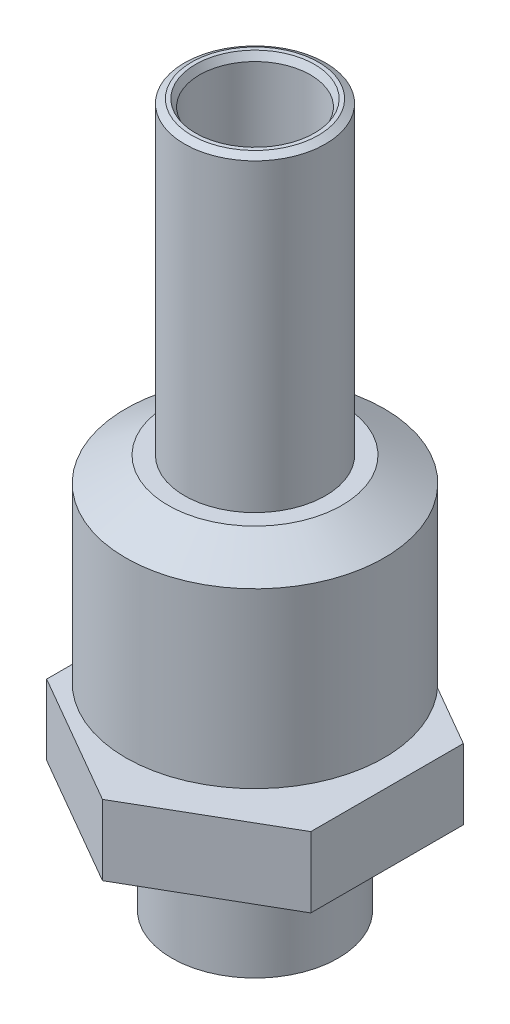
ISO-10303-21;
HEADER;
FILE_DESCRIPTION(('STEP AP214'),'2;1');
FILE_NAME('part.step','',(''),(''),'','','');
FILE_SCHEMA(('AUTOMOTIVE_DESIGN { 1 0 10303 214 1 1 1 1 }'));
ENDSEC;
DATA;
#1=APPLICATION_CONTEXT('core data for automotive mechanical design processes');
#2=APPLICATION_PROTOCOL_DEFINITION('international standard','automotive_design',2000,#1);
#3=PRODUCT_CONTEXT('',#1,'mechanical');
#4=PRODUCT('Part','Part','',(#3));
#5=PRODUCT_RELATED_PRODUCT_CATEGORY('part','',(#4));
#6=PRODUCT_DEFINITION_FORMATION('','',#4);
#7=PRODUCT_DEFINITION_CONTEXT('part definition',#1,'design');
#8=PRODUCT_DEFINITION('design','',#6,#7);
#9=PRODUCT_DEFINITION_SHAPE('','',#8);
#10=(LENGTH_UNIT() NAMED_UNIT(*) SI_UNIT(.MILLI.,.METRE.));
#11=(NAMED_UNIT(*) PLANE_ANGLE_UNIT() SI_UNIT($,.RADIAN.));
#12=(NAMED_UNIT(*) SI_UNIT($,.STERADIAN.) SOLID_ANGLE_UNIT());
#13=UNCERTAINTY_MEASURE_WITH_UNIT(LENGTH_MEASURE(1.E-05),#10,'distance_accuracy_value','');
#14=(GEOMETRIC_REPRESENTATION_CONTEXT(3) GLOBAL_UNCERTAINTY_ASSIGNED_CONTEXT((#13)) GLOBAL_UNIT_ASSIGNED_CONTEXT((#10,
#11,#12)) REPRESENTATION_CONTEXT('',''));
#15=CARTESIAN_POINT('',(0.,0.,0.));
#16=DIRECTION('',(0.,0.,1.));
#17=DIRECTION('',(1.,0.,0.));
#18=AXIS2_PLACEMENT_3D('',#15,#16,#17);
#19=CARTESIAN_POINT('',(4.7625,27.432,2.74963065701559));
#20=DIRECTION('',(-1.,0.,0.));
#21=DIRECTION('',(0.,0.,1.));
#22=AXIS2_PLACEMENT_3D('',#19,#20,#21);
#23=PLANE('',#22);
#24=DIRECTION('',(0.,0.,1.));
#25=VECTOR('',#24,1.);
#26=CARTESIAN_POINT('',(4.7625,5.762,2.74963065701559));
#27=LINE('',#26,#25);
#28=CARTESIAN_POINT('',(4.7625,5.762,-2.74963065701559));
#29=VERTEX_POINT('',#28);
#30=CARTESIAN_POINT('',(4.7625,5.762,2.74963065701559));
#31=VERTEX_POINT('',#30);
#32=EDGE_CURVE('E53',#29,#31,#27,.T.);
#33=ORIENTED_EDGE('',*,*,#32,.F.);
#34=DIRECTION('',(0.,-1.,0.));
#35=VECTOR('',#34,1.);
#36=CARTESIAN_POINT('',(4.7625,27.432,-2.74963065701559));
#37=LINE('',#36,#35);
#38=CARTESIAN_POINT('',(4.7625,8.302,-2.74963065701559));
#39=VERTEX_POINT('',#38);
#40=EDGE_CURVE('E121',#39,#29,#37,.T.);
#41=ORIENTED_EDGE('',*,*,#40,.F.);
#42=DIRECTION('',(0.,0.,1.));
#43=VECTOR('',#42,1.);
#44=CARTESIAN_POINT('',(4.7625,8.302,2.74963065701559));
#45=LINE('',#44,#43);
#46=CARTESIAN_POINT('',(4.7625,8.302,2.74963065701559));
#47=VERTEX_POINT('',#46);
#48=EDGE_CURVE('E112',#39,#47,#45,.T.);
#49=ORIENTED_EDGE('',*,*,#48,.T.);
#50=DIRECTION('',(0.,-1.,0.));
#51=VECTOR('',#50,1.);
#52=CARTESIAN_POINT('',(4.7625,27.432,2.74963065701559));
#53=LINE('',#52,#51);
#54=EDGE_CURVE('E108',#47,#31,#53,.T.);
#55=ORIENTED_EDGE('',*,*,#54,.T.);
#56=EDGE_LOOP('',(#33,#41,#49,#55));
#57=FACE_BOUND('',#56,.T.);
#58=ADVANCED_FACE('F39',(#57),#23,.F.);
#59=CARTESIAN_POINT('',(4.7625,27.432,-2.74963065701559));
#60=DIRECTION('',(-0.5,0.,0.866025403784439));
#61=DIRECTION('',(0.866025403784439,0.,0.5));
#62=AXIS2_PLACEMENT_3D('',#59,#60,#61);
#63=PLANE('',#62);
#64=DIRECTION('',(0.866025403784439,0.,0.5));
#65=VECTOR('',#64,1.);
#66=CARTESIAN_POINT('',(4.76249999999999,5.762,-2.7496306570156));
#67=LINE('',#66,#65);
#68=CARTESIAN_POINT('',(0.,5.762,-5.49926131403118));
#69=VERTEX_POINT('',#68);
#70=EDGE_CURVE('E157',#69,#29,#67,.T.);
#71=ORIENTED_EDGE('',*,*,#70,.F.);
#72=DIRECTION('',(0.,-1.,0.));
#73=VECTOR('',#72,1.);
#74=CARTESIAN_POINT('',(0.,27.432,-5.49926131403118));
#75=LINE('',#74,#73);
#76=CARTESIAN_POINT('',(0.,8.302,-5.49926131403118));
#77=VERTEX_POINT('',#76);
#78=EDGE_CURVE('E118',#77,#69,#75,.T.);
#79=ORIENTED_EDGE('',*,*,#78,.F.);
#80=DIRECTION('',(0.866025403784439,0.,0.5));
#81=VECTOR('',#80,1.);
#82=CARTESIAN_POINT('',(4.7625,8.302,-2.74963065701559));
#83=LINE('',#82,#81);
#84=EDGE_CURVE('E192',#77,#39,#83,.T.);
#85=ORIENTED_EDGE('',*,*,#84,.T.);
#86=ORIENTED_EDGE('',*,*,#40,.T.);
#87=EDGE_LOOP('',(#71,#79,#85,#86));
#88=FACE_BOUND('',#87,.T.);
#89=ADVANCED_FACE('F201',(#88),#63,.F.);
#90=CARTESIAN_POINT('',(0.,27.432,-5.49926131403118));
#91=DIRECTION('',(0.500000000000001,0.,0.866025403784438));
#92=DIRECTION('',(0.866025403784438,0.,-0.500000000000001));
#93=AXIS2_PLACEMENT_3D('',#90,#91,#92);
#94=PLANE('',#93);
#95=DIRECTION('',(0.866025403784438,0.,-0.500000000000001));
#96=VECTOR('',#95,1.);
#97=CARTESIAN_POINT('',(0.,5.762,-5.49926131403118));
#98=LINE('',#97,#96);
#99=CARTESIAN_POINT('',(-4.7625,5.762,-2.74963065701559));
#100=VERTEX_POINT('',#99);
#101=EDGE_CURVE('E155',#100,#69,#98,.T.);
#102=ORIENTED_EDGE('',*,*,#101,.F.);
#103=DIRECTION('',(0.,-1.,0.));
#104=VECTOR('',#103,1.);
#105=CARTESIAN_POINT('',(-4.7625,27.432,-2.74963065701559));
#106=LINE('',#105,#104);
#107=CARTESIAN_POINT('',(-4.7625,8.302,-2.74963065701559));
#108=VERTEX_POINT('',#107);
#109=EDGE_CURVE('E110',#108,#100,#106,.T.);
#110=ORIENTED_EDGE('',*,*,#109,.F.);
#111=DIRECTION('',(0.866025403784438,0.,-0.500000000000001));
#112=VECTOR('',#111,1.);
#113=CARTESIAN_POINT('',(0.,8.302,-5.49926131403118));
#114=LINE('',#113,#112);
#115=EDGE_CURVE('E189',#108,#77,#114,.T.);
#116=ORIENTED_EDGE('',*,*,#115,.T.);
#117=ORIENTED_EDGE('',*,*,#78,.T.);
#118=EDGE_LOOP('',(#102,#110,#116,#117));
#119=FACE_BOUND('',#118,.T.);
#120=ADVANCED_FACE('F204',(#119),#94,.F.);
#121=CARTESIAN_POINT('',(-4.7625,27.432,-2.74963065701559));
#122=DIRECTION('',(1.,0.,0.));
#123=DIRECTION('',(0.,0.,-1.));
#124=AXIS2_PLACEMENT_3D('',#121,#122,#123);
#125=PLANE('',#124);
#126=DIRECTION('',(0.,0.,-1.));
#127=VECTOR('',#126,1.);
#128=CARTESIAN_POINT('',(-4.7625,5.762,-2.74963065701559));
#129=LINE('',#128,#127);
#130=CARTESIAN_POINT('',(-4.7625,5.762,2.7496306570156));
#131=VERTEX_POINT('',#130);
#132=EDGE_CURVE('E103',#131,#100,#129,.T.);
#133=ORIENTED_EDGE('',*,*,#132,.F.);
#134=DIRECTION('',(0.,-1.,0.));
#135=VECTOR('',#134,1.);
#136=CARTESIAN_POINT('',(-4.7625,27.432,2.7496306570156));
#137=LINE('',#136,#135);
#138=CARTESIAN_POINT('',(-4.7625,8.302,2.7496306570156));
#139=VERTEX_POINT('',#138);
#140=EDGE_CURVE('E102',#139,#131,#137,.T.);
#141=ORIENTED_EDGE('',*,*,#140,.F.);
#142=DIRECTION('',(0.,0.,-1.));
#143=VECTOR('',#142,1.);
#144=CARTESIAN_POINT('',(-4.7625,8.302,-2.74963065701559));
#145=LINE('',#144,#143);
#146=EDGE_CURVE('E186',#139,#108,#145,.T.);
#147=ORIENTED_EDGE('',*,*,#146,.T.);
#148=ORIENTED_EDGE('',*,*,#109,.T.);
#149=EDGE_LOOP('',(#133,#141,#147,#148));
#150=FACE_BOUND('',#149,.T.);
#151=ADVANCED_FACE('F207',(#150),#125,.F.);
#152=CARTESIAN_POINT('',(-4.7625,27.432,2.7496306570156));
#153=DIRECTION('',(0.5,0.,-0.866025403784439));
#154=DIRECTION('',(-0.866025403784439,0.,-0.5));
#155=AXIS2_PLACEMENT_3D('',#152,#153,#154);
#156=PLANE('',#155);
#157=DIRECTION('',(-0.866025403784439,0.,-0.5));
#158=VECTOR('',#157,1.);
#159=CARTESIAN_POINT('',(-4.7625,5.762,2.74963065701559));
#160=LINE('',#159,#158);
#161=CARTESIAN_POINT('',(0.,5.762,5.49926131403119));
#162=VERTEX_POINT('',#161);
#163=EDGE_CURVE('E90',#162,#131,#160,.T.);
#164=ORIENTED_EDGE('',*,*,#163,.F.);
#165=DIRECTION('',(0.,-1.,0.));
#166=VECTOR('',#165,1.);
#167=CARTESIAN_POINT('',(0.,27.432,5.49926131403119));
#168=LINE('',#167,#166);
#169=CARTESIAN_POINT('',(0.,8.302,5.49926131403119));
#170=VERTEX_POINT('',#169);
#171=EDGE_CURVE('E100',#170,#162,#168,.T.);
#172=ORIENTED_EDGE('',*,*,#171,.F.);
#173=DIRECTION('',(-0.866025403784439,0.,-0.5));
#174=VECTOR('',#173,1.);
#175=CARTESIAN_POINT('',(-4.7625,8.302,2.7496306570156));
#176=LINE('',#175,#174);
#177=EDGE_CURVE('E61',#170,#139,#176,.T.);
#178=ORIENTED_EDGE('',*,*,#177,.T.);
#179=ORIENTED_EDGE('',*,*,#140,.T.);
#180=EDGE_LOOP('',(#164,#172,#178,#179));
#181=FACE_BOUND('',#180,.T.);
#182=ADVANCED_FACE('F99',(#181),#156,.F.);
#183=CARTESIAN_POINT('',(0.,27.432,5.49926131403119));
#184=DIRECTION('',(-0.5,0.,-0.866025403784438));
#185=DIRECTION('',(-0.866025403784438,0.,0.5));
#186=AXIS2_PLACEMENT_3D('',#183,#184,#185);
#187=PLANE('',#186);
#188=DIRECTION('',(-0.866025403784438,0.,0.5));
#189=VECTOR('',#188,1.);
#190=CARTESIAN_POINT('',(0.,5.762,5.49926131403119));
#191=LINE('',#190,#189);
#192=EDGE_CURVE('E11',#31,#162,#191,.T.);
#193=ORIENTED_EDGE('',*,*,#192,.F.);
#194=ORIENTED_EDGE('',*,*,#54,.F.);
#195=DIRECTION('',(-0.866025403784438,0.,0.5));
#196=VECTOR('',#195,1.);
#197=CARTESIAN_POINT('',(0.,8.302,5.49926131403119));
#198=LINE('',#197,#196);
#199=EDGE_CURVE('E107',#47,#170,#198,.T.);
#200=ORIENTED_EDGE('',*,*,#199,.T.);
#201=ORIENTED_EDGE('',*,*,#171,.T.);
#202=EDGE_LOOP('',(#193,#194,#200,#201));
#203=FACE_BOUND('',#202,.T.);
#204=ADVANCED_FACE('F106',(#203),#187,.F.);
#205=CARTESIAN_POINT('',(0.,1.39107264208463,0.));
#206=DIRECTION('',(0.,1.,0.));
#207=DIRECTION('',(0.,0.,1.));
#208=AXIS2_PLACEMENT_3D('',#205,#206,#207);
#209=CONICAL_SURFACE('',#208,0.,1.08210413623648);
#210=CARTESIAN_POINT('',(0.,1.92116035997955,0.));
#211=DIRECTION('',(0.,-1.,0.));
#212=DIRECTION('',(0.,0.,-1.));
#213=AXIS2_PLACEMENT_3D('',#210,#211,#212);
#214=CIRCLE('',#213,0.996949999999998);
#215=CARTESIAN_POINT('',(0.,1.92116035997955,0.996949999999998));
#216=VERTEX_POINT('',#215);
#217=EDGE_CURVE('E160',#216,#216,#214,.T.);
#218=CARTESIAN_POINT('',(0.,1.524,0.));
#219=DIRECTION('',(0.,-1.,0.));
#220=DIRECTION('',(1.,0.,0.));
#221=AXIS2_PLACEMENT_3D('',#218,#219,#220);
#222=CIRCLE('',#221,0.249999999999995);
#223=CARTESIAN_POINT('',(0.,1.524,0.249999999999995));
#224=VERTEX_POINT('',#223);
#225=EDGE_CURVE('E104',#224,#224,#222,.F.);
#226=CARTESIAN_POINT('',(0.,1.92116035997955,0.996949999999998));
#227=CARTESIAN_POINT('',(0.,1.91702327289643,0.989169270833332));
#228=CARTESIAN_POINT('',(0.,1.91288618581331,0.981388541666665));
#229=CARTESIAN_POINT('',(0.,1.90461201164707,0.965827083333331));
#230=CARTESIAN_POINT('',(0.,1.90047492456395,0.958046354166665));
#231=CARTESIAN_POINT('',(0.,1.89220075039771,0.942484895833331));
#232=CARTESIAN_POINT('',(0.,1.88806366331458,0.934704166666665));
#233=CARTESIAN_POINT('',(0.,1.87978948914834,0.919142708333331));
#234=CARTESIAN_POINT('',(0.,1.87565240206522,0.911361979166665));
#235=CARTESIAN_POINT('',(0.,1.86737822789898,0.895800520833331));
#236=CARTESIAN_POINT('',(0.,1.86324114081586,0.888019791666664));
#237=CARTESIAN_POINT('',(0.,1.85496696664962,0.872458333333331));
#238=CARTESIAN_POINT('',(0.,1.8508298795665,0.864677604166664));
#239=CARTESIAN_POINT('',(0.,1.84255570540026,0.849116145833331));
#240=CARTESIAN_POINT('',(0.,1.83841861831714,0.841335416666664));
#241=CARTESIAN_POINT('',(0.,1.8301444441509,0.825773958333331));
#242=CARTESIAN_POINT('',(0.,1.82600735706778,0.817993229166664));
#243=CARTESIAN_POINT('',(0.,1.81773318290154,0.802431770833331));
#244=CARTESIAN_POINT('',(0.,1.81359609581842,0.794651041666664));
#245=CARTESIAN_POINT('',(0.,1.80532192165218,0.779089583333331));
#246=CARTESIAN_POINT('',(0.,1.80118483456906,0.771308854166664));
#247=CARTESIAN_POINT('',(0.,1.79291066040282,0.755747395833331));
#248=CARTESIAN_POINT('',(0.,1.7887735733197,0.747966666666664));
#249=CARTESIAN_POINT('',(0.,1.78049939915346,0.73240520833333));
#250=CARTESIAN_POINT('',(0.,1.77636231207034,0.724624479166664));
#251=CARTESIAN_POINT('',(0.,1.7680881379041,0.70906302083333));
#252=CARTESIAN_POINT('',(0.,1.76395105082098,0.701282291666664));
#253=CARTESIAN_POINT('',(0.,1.75567687665474,0.68572083333333));
#254=CARTESIAN_POINT('',(0.,1.75153978957162,0.677940104166664));
#255=CARTESIAN_POINT('',(0.,1.74326561540537,0.66237864583333));
#256=CARTESIAN_POINT('',(0.,1.73912852832225,0.654597916666663));
#257=CARTESIAN_POINT('',(0.,1.73085435415601,0.63903645833333));
#258=CARTESIAN_POINT('',(0.,1.72671726707289,0.631255729166663));
#259=CARTESIAN_POINT('',(0.,1.71844309290665,0.61569427083333));
#260=CARTESIAN_POINT('',(0.,1.71430600582353,0.607913541666663));
#261=CARTESIAN_POINT('',(0.,1.70603183165729,0.59235208333333));
#262=CARTESIAN_POINT('',(0.,1.70189474457417,0.584571354166663));
#263=CARTESIAN_POINT('',(0.,1.69362057040793,0.56900989583333));
#264=CARTESIAN_POINT('',(0.,1.68948348332481,0.561229166666663));
#265=CARTESIAN_POINT('',(0.,1.68120930915857,0.545667708333329));
#266=CARTESIAN_POINT('',(0.,1.67707222207545,0.537886979166663));
#267=CARTESIAN_POINT('',(0.,1.66879804790921,0.522325520833329));
#268=CARTESIAN_POINT('',(0.,1.66466096082609,0.514544791666663));
#269=CARTESIAN_POINT('',(0.,1.65638678665985,0.498983333333329));
#270=CARTESIAN_POINT('',(0.,1.65224969957673,0.491202604166663));
#271=CARTESIAN_POINT('',(0.,1.64397552541049,0.475641145833329));
#272=CARTESIAN_POINT('',(0.,1.63983843832737,0.467860416666663));
#273=CARTESIAN_POINT('',(0.,1.63156426416113,0.452298958333329));
#274=CARTESIAN_POINT('',(0.,1.62742717707801,0.444518229166662));
#275=CARTESIAN_POINT('',(0.,1.61915300291177,0.428956770833329));
#276=CARTESIAN_POINT('',(0.,1.61501591582865,0.421176041666662));
#277=CARTESIAN_POINT('',(0.,1.60674174166241,0.405614583333329));
#278=CARTESIAN_POINT('',(0.,1.60260465457929,0.397833854166662));
#279=CARTESIAN_POINT('',(0.,1.59433048041304,0.382272395833329));
#280=CARTESIAN_POINT('',(0.,1.59019339332992,0.374491666666662));
#281=CARTESIAN_POINT('',(0.,1.58191921916368,0.358930208333329));
#282=CARTESIAN_POINT('',(0.,1.57778213208056,0.351149479166662));
#283=CARTESIAN_POINT('',(0.,1.56950795791432,0.335588020833329));
#284=CARTESIAN_POINT('',(0.,1.5653708708312,0.327807291666662));
#285=CARTESIAN_POINT('',(0.,1.55709669666496,0.312245833333328));
#286=CARTESIAN_POINT('',(0.,1.55295960958184,0.304465104166662));
#287=CARTESIAN_POINT('',(0.,1.5446854354156,0.288903645833328));
#288=CARTESIAN_POINT('',(0.,1.54054834833248,0.281122916666662));
#289=CARTESIAN_POINT('',(0.,1.53227417416624,0.265561458333328));
#290=CARTESIAN_POINT('',(0.,1.52813708708312,0.257780729166661));
#291=CARTESIAN_POINT('',(0.,1.524,0.249999999999995));
#292=B_SPLINE_CURVE_WITH_KNOTS('',3,(#226,#227,#228,#229,#230,#231,#232,#233,#234,#235,#236,
#237,#238,#239,#240,#241,#242,#243,#244,#245,#246,#247,#248,#249,#250,#251,#252,#253,#254,#255,
#256,#257,#258,#259,#260,#261,#262,#263,#264,#265,#266,#267,#268,#269,#270,#271,#272,#273,#274,
#275,#276,#277,#278,#279,#280,#281,#282,#283,#284,#285,#286,#287,#288,#289,#290,#291),
.UNSPECIFIED.,.F.,.F.,(4,2,2,2,2,2,2,2,2,2,2,2,2,2,2,2,2,2,2,2,2,2,2,2,2,2,2,2,2,2,2,2,4),(0.,
0.0264366624800681,0.0528733249601363,0.0793099874402046,0.105746649920273,0.132183312400341,
0.158619974880409,0.185056637360478,0.211493299840546,0.237929962320614,0.264366624800682,
0.290803287280751,0.317239949760819,0.343676612240887,0.370113274720955,0.396549937201023,
0.422986599681092,0.44942326216116,0.475859924641228,0.502296587121296,0.528733249601364,
0.555169912081433,0.581606574561501,0.608043237041569,0.634479899521638,0.660916562001706,
0.687353224481774,0.713789886961842,0.740226549441911,0.766663211921979,0.793099874402047,
0.819536536882115,0.845973199362184),.UNSPECIFIED.);
#293=EDGE_CURVE('BSEAM268',#216,#224,#292,.T.);
#294=ORIENTED_EDGE('',*,*,#217,.F.);
#295=ORIENTED_EDGE('',*,*,#225,.F.);
#296=ORIENTED_EDGE('',*,*,#293,.T.);
#297=ORIENTED_EDGE('',*,*,#293,.F.);
#298=EDGE_LOOP('',(#294,#296,#295,#297));
#299=FACE_BOUND('',#298,.T.);
#300=ADVANCED_FACE('F268',(#299),#209,.F.);
#301=CARTESIAN_POINT('',(0.,8.302,0.));
#302=DIRECTION('',(0.,-1.,0.));
#303=DIRECTION('',(0.,0.,-1.));
#304=AXIS2_PLACEMENT_3D('',#301,#302,#303);
#305=PLANE('',#304);
#306=CARTESIAN_POINT('',(0.,8.302,0.));
#307=DIRECTION('',(0.,-1.,0.));
#308=DIRECTION('',(0.,0.,-1.));
#309=AXIS2_PLACEMENT_3D('',#306,#307,#308);
#310=CIRCLE('',#309,3.1369);
#311=CARTESIAN_POINT('',(0.,8.302,-3.1369));
#312=VERTEX_POINT('',#311);
#313=EDGE_CURVE('E182',#312,#312,#310,.T.);
#314=ORIENTED_EDGE('',*,*,#313,.T.);
#315=EDGE_LOOP('',(#314));
#316=FACE_BOUND('',#315,.T.);
#317=ORIENTED_EDGE('',*,*,#84,.F.);
#318=ORIENTED_EDGE('',*,*,#115,.F.);
#319=ORIENTED_EDGE('',*,*,#146,.F.);
#320=ORIENTED_EDGE('',*,*,#177,.F.);
#321=ORIENTED_EDGE('',*,*,#199,.F.);
#322=ORIENTED_EDGE('',*,*,#48,.F.);
#323=EDGE_LOOP('',(#317,#318,#319,#320,#321,#322));
#324=FACE_BOUND('',#323,.T.);
#325=ADVANCED_FACE('F197',(#316,#324),#305,.F.);
#326=CARTESIAN_POINT('',(0.,9.181881810245,0.));
#327=DIRECTION('',(0.,1.,0.));
#328=DIRECTION('',(0.,0.,1.));
#329=AXIS2_PLACEMENT_3D('',#326,#327,#328);
#330=CONICAL_SURFACE('',#329,4.6609,1.04719755119659);
#331=ORIENTED_EDGE('',*,*,#313,.F.);
#332=EDGE_LOOP('',(#331));
#333=FACE_BOUND('',#332,.T.);
#334=CARTESIAN_POINT('',(0.,9.181881810245,0.));
#335=DIRECTION('',(0.,-1.,0.));
#336=DIRECTION('',(0.,0.,-1.));
#337=AXIS2_PLACEMENT_3D('',#334,#335,#336);
#338=CIRCLE('',#337,4.6609);
#339=CARTESIAN_POINT('',(0.,9.181881810245,-4.6609));
#340=VERTEX_POINT('',#339);
#341=EDGE_CURVE('E179',#340,#340,#338,.T.);
#342=ORIENTED_EDGE('',*,*,#341,.T.);
#343=EDGE_LOOP('',(#342));
#344=FACE_BOUND('',#343,.T.);
#345=ADVANCED_FACE('F261',(#333,#344),#330,.T.);
#346=CARTESIAN_POINT('',(0.,0.,0.));
#347=DIRECTION('',(0.,-1.,0.));
#348=DIRECTION('',(0.,0.,-1.));
#349=AXIS2_PLACEMENT_3D('',#346,#347,#348);
#350=CYLINDRICAL_SURFACE('',#349,4.6609);
#351=ORIENTED_EDGE('',*,*,#341,.F.);
#352=EDGE_LOOP('',(#351));
#353=FACE_BOUND('',#352,.T.);
#354=CARTESIAN_POINT('',(0.,15.422118189755,0.));
#355=DIRECTION('',(0.,-1.,0.));
#356=DIRECTION('',(0.,0.,-1.));
#357=AXIS2_PLACEMENT_3D('',#354,#355,#356);
#358=CIRCLE('',#357,4.6609);
#359=CARTESIAN_POINT('',(0.,15.422118189755,-4.6609));
#360=VERTEX_POINT('',#359);
#361=EDGE_CURVE('E176',#360,#360,#358,.T.);
#362=ORIENTED_EDGE('',*,*,#361,.T.);
#363=EDGE_LOOP('',(#362));
#364=FACE_BOUND('',#363,.T.);
#365=ADVANCED_FACE('F253',(#353,#364),#350,.T.);
#366=CARTESIAN_POINT('',(0.,16.302,0.));
#367=DIRECTION('',(0.,-1.,0.));
#368=DIRECTION('',(0.,0.,-1.));
#369=AXIS2_PLACEMENT_3D('',#366,#367,#368);
#370=CONICAL_SURFACE('',#369,3.1369,1.0471975511966);
#371=ORIENTED_EDGE('',*,*,#361,.F.);
#372=EDGE_LOOP('',(#371));
#373=FACE_BOUND('',#372,.T.);
#374=CARTESIAN_POINT('',(0.,16.302,0.));
#375=DIRECTION('',(0.,-1.,0.));
#376=DIRECTION('',(0.,0.,-1.));
#377=AXIS2_PLACEMENT_3D('',#374,#375,#376);
#378=CIRCLE('',#377,3.1369);
#379=CARTESIAN_POINT('',(0.,16.302,-3.1369));
#380=VERTEX_POINT('',#379);
#381=EDGE_CURVE('E173',#380,#380,#378,.T.);
#382=ORIENTED_EDGE('',*,*,#381,.T.);
#383=EDGE_LOOP('',(#382));
#384=FACE_BOUND('',#383,.T.);
#385=ADVANCED_FACE('F247',(#373,#384),#370,.T.);
#386=CARTESIAN_POINT('',(0.,16.302,0.));
#387=DIRECTION('',(0.,-1.,0.));
#388=DIRECTION('',(0.,0.,-1.));
#389=AXIS2_PLACEMENT_3D('',#386,#387,#388);
#390=PLANE('',#389);
#391=ORIENTED_EDGE('',*,*,#381,.F.);
#392=EDGE_LOOP('',(#391));
#393=FACE_BOUND('',#392,.T.);
#394=CARTESIAN_POINT('',(0.,16.302,0.));
#395=DIRECTION('',(0.,-1.,0.));
#396=DIRECTION('',(0.,0.,-1.));
#397=AXIS2_PLACEMENT_3D('',#394,#395,#396);
#398=CIRCLE('',#397,2.54);
#399=CARTESIAN_POINT('',(0.,16.302,-2.54));
#400=VERTEX_POINT('',#399);
#401=EDGE_CURVE('E170',#400,#400,#398,.T.);
#402=ORIENTED_EDGE('',*,*,#401,.T.);
#403=EDGE_LOOP('',(#402));
#404=FACE_BOUND('',#403,.T.);
#405=ADVANCED_FACE('F242',(#393,#404),#390,.F.);
#406=CARTESIAN_POINT('',(0.,0.,0.));
#407=DIRECTION('',(0.,-1.,0.));
#408=DIRECTION('',(0.,0.,-1.));
#409=AXIS2_PLACEMENT_3D('',#406,#407,#408);
#410=CYLINDRICAL_SURFACE('',#409,2.54);
#411=CARTESIAN_POINT('',(0.,27.2853530316258,0.));
#412=DIRECTION('',(0.,1.,0.));
#413=DIRECTION('',(0.,0.,1.));
#414=AXIS2_PLACEMENT_3D('',#411,#412,#413);
#415=CIRCLE('',#414,2.54);
#416=CARTESIAN_POINT('',(0.,27.2853530316258,2.54));
#417=VERTEX_POINT('',#416);
#418=EDGE_CURVE('E125',#417,#417,#415,.F.);
#419=ORIENTED_EDGE('',*,*,#418,.T.);
#420=EDGE_LOOP('',(#419));
#421=FACE_BOUND('',#420,.T.);
#422=ORIENTED_EDGE('',*,*,#401,.F.);
#423=EDGE_LOOP('',(#422));
#424=FACE_BOUND('',#423,.T.);
#425=ADVANCED_FACE('F238',(#421,#424),#410,.T.);
#426=CARTESIAN_POINT('',(0.,27.432,0.));
#427=DIRECTION('',(0.,1.,0.));
#428=DIRECTION('',(0.,0.,1.));
#429=AXIS2_PLACEMENT_3D('',#426,#427,#428);
#430=PLANE('',#429);
#431=CARTESIAN_POINT('',(0.,27.432,0.));
#432=DIRECTION('',(0.,1.,0.));
#433=DIRECTION('',(0.,0.,1.));
#434=AXIS2_PLACEMENT_3D('',#431,#432,#433);
#435=CIRCLE('',#434,2.28600000000001);
#436=CARTESIAN_POINT('',(0.,27.432,2.28600000000001));
#437=VERTEX_POINT('',#436);
#438=EDGE_CURVE('E131',#437,#437,#435,.T.);
#439=ORIENTED_EDGE('',*,*,#438,.T.);
#440=EDGE_LOOP('',(#439));
#441=FACE_BOUND('',#440,.T.);
#442=CARTESIAN_POINT('',(0.,27.432,0.));
#443=DIRECTION('',(0.,1.,0.));
#444=DIRECTION('',(0.,0.,1.));
#445=AXIS2_PLACEMENT_3D('',#442,#443,#444);
#446=CIRCLE('',#445,2.14664696837416);
#447=CARTESIAN_POINT('',(0.,27.432,2.14664696837416));
#448=VERTEX_POINT('',#447);
#449=EDGE_CURVE('E128',#448,#448,#446,.F.);
#450=ORIENTED_EDGE('',*,*,#449,.T.);
#451=EDGE_LOOP('',(#450));
#452=FACE_BOUND('',#451,.T.);
#453=ADVANCED_FACE('F241',(#441,#452),#430,.T.);
#454=CARTESIAN_POINT('',(0.,0.,0.));
#455=DIRECTION('',(0.,-1.,0.));
#456=DIRECTION('',(0.,0.,-1.));
#457=AXIS2_PLACEMENT_3D('',#454,#455,#456);
#458=CYLINDRICAL_SURFACE('',#457,2.);
#459=CARTESIAN_POINT('',(0.,27.178,0.));
#460=DIRECTION('',(0.,1.,0.));
#461=DIRECTION('',(0.,0.,1.));
#462=AXIS2_PLACEMENT_3D('',#459,#460,#461);
#463=CIRCLE('',#462,2.);
#464=CARTESIAN_POINT('',(0.,27.178,2.));
#465=VERTEX_POINT('',#464);
#466=EDGE_CURVE('E47',#465,#465,#463,.T.);
#467=ORIENTED_EDGE('',*,*,#466,.T.);
#468=EDGE_LOOP('',(#467));
#469=FACE_BOUND('',#468,.T.);
#470=CARTESIAN_POINT('',(0.,21.082,0.));
#471=DIRECTION('',(0.,-1.,0.));
#472=DIRECTION('',(0.,0.,-1.));
#473=AXIS2_PLACEMENT_3D('',#470,#471,#472);
#474=CIRCLE('',#473,2.);
#475=CARTESIAN_POINT('',(0.,21.082,-2.));
#476=VERTEX_POINT('',#475);
#477=EDGE_CURVE('E167',#476,#476,#474,.T.);
#478=ORIENTED_EDGE('',*,*,#477,.T.);
#479=EDGE_LOOP('',(#478));
#480=FACE_BOUND('',#479,.T.);
#481=ADVANCED_FACE('F272',(#469,#480),#458,.F.);
#482=CARTESIAN_POINT('',(0.,21.082,0.));
#483=DIRECTION('',(0.,1.,0.));
#484=DIRECTION('',(0.,0.,1.));
#485=AXIS2_PLACEMENT_3D('',#482,#483,#484);
#486=PLANE('',#485);
#487=CARTESIAN_POINT('',(0.,21.082,0.));
#488=DIRECTION('',(0.,-1.,0.));
#489=DIRECTION('',(0.,0.,-1.));
#490=AXIS2_PLACEMENT_3D('',#487,#488,#489);
#491=CIRCLE('',#490,0.99695);
#492=CARTESIAN_POINT('',(0.,21.082,-0.99695));
#493=VERTEX_POINT('',#492);
#494=EDGE_CURVE('E164',#493,#493,#491,.T.);
#495=ORIENTED_EDGE('',*,*,#494,.T.);
#496=EDGE_LOOP('',(#495));
#497=FACE_BOUND('',#496,.T.);
#498=ORIENTED_EDGE('',*,*,#477,.F.);
#499=EDGE_LOOP('',(#498));
#500=FACE_BOUND('',#499,.T.);
#501=ADVANCED_FACE('F231',(#497,#500),#486,.T.);
#502=CARTESIAN_POINT('',(0.,0.,0.));
#503=DIRECTION('',(0.,-1.,0.));
#504=DIRECTION('',(0.,0.,-1.));
#505=AXIS2_PLACEMENT_3D('',#502,#503,#504);
#506=CYLINDRICAL_SURFACE('',#505,0.996949999999999);
#507=ORIENTED_EDGE('',*,*,#217,.T.);
#508=EDGE_LOOP('',(#507));
#509=FACE_BOUND('',#508,.T.);
#510=ORIENTED_EDGE('',*,*,#494,.F.);
#511=EDGE_LOOP('',(#510));
#512=FACE_BOUND('',#511,.T.);
#513=ADVANCED_FACE('F224',(#509,#512),#506,.F.);
#514=CARTESIAN_POINT('',(0.,27.2853530316258,0.));
#515=DIRECTION('',(0.,-1.,0.));
#516=DIRECTION('',(0.,0.,-1.));
#517=AXIS2_PLACEMENT_3D('',#514,#515,#516);
#518=CONICAL_SURFACE('',#517,2.54,1.0471975511966);
#519=ORIENTED_EDGE('',*,*,#438,.F.);
#520=EDGE_LOOP('',(#519));
#521=FACE_BOUND('',#520,.T.);
#522=ORIENTED_EDGE('',*,*,#418,.F.);
#523=EDGE_LOOP('',(#522));
#524=FACE_BOUND('',#523,.T.);
#525=ADVANCED_FACE('F222',(#521,#524),#518,.T.);
#526=CARTESIAN_POINT('',(0.,27.432,0.));
#527=DIRECTION('',(0.,1.,0.));
#528=DIRECTION('',(0.,0.,1.));
#529=AXIS2_PLACEMENT_3D('',#526,#527,#528);
#530=CONICAL_SURFACE('',#529,2.14664696837416,0.523598775598291);
#531=ORIENTED_EDGE('',*,*,#466,.F.);
#532=EDGE_LOOP('',(#531));
#533=FACE_BOUND('',#532,.T.);
#534=ORIENTED_EDGE('',*,*,#449,.F.);
#535=EDGE_LOOP('',(#534));
#536=FACE_BOUND('',#535,.T.);
#537=ADVANCED_FACE('F41',(#533,#536),#530,.F.);
#538=CARTESIAN_POINT('',(-3.,5.762,0.));
#539=DIRECTION('',(0.,-1.,0.));
#540=DIRECTION('',(1.,0.,0.));
#541=AXIS2_PLACEMENT_3D('',#538,#539,#540);
#542=PLANE('',#541);
#543=CARTESIAN_POINT('',(0.,5.762,0.));
#544=DIRECTION('',(0.,-1.,0.));
#545=DIRECTION('',(1.,0.,0.));
#546=AXIS2_PLACEMENT_3D('',#543,#544,#545);
#547=CIRCLE('',#546,3.);
#548=CARTESIAN_POINT('',(3.,5.762,0.));
#549=VERTEX_POINT('',#548);
#550=EDGE_CURVE('E479',#549,#549,#547,.T.);
#551=ORIENTED_EDGE('',*,*,#550,.F.);
#552=EDGE_LOOP('',(#551));
#553=FACE_BOUND('',#552,.T.);
#554=ORIENTED_EDGE('',*,*,#32,.T.);
#555=ORIENTED_EDGE('',*,*,#192,.T.);
#556=ORIENTED_EDGE('',*,*,#163,.T.);
#557=ORIENTED_EDGE('',*,*,#132,.T.);
#558=ORIENTED_EDGE('',*,*,#101,.T.);
#559=ORIENTED_EDGE('',*,*,#70,.T.);
#560=EDGE_LOOP('',(#554,#555,#556,#557,#558,#559));
#561=FACE_BOUND('',#560,.T.);
#562=ADVANCED_FACE('F89',(#553,#561),#542,.T.);
#563=CARTESIAN_POINT('',(0.,1.524,0.));
#564=DIRECTION('',(0.,-1.,0.));
#565=DIRECTION('',(1.,0.,0.));
#566=AXIS2_PLACEMENT_3D('',#563,#564,#565);
#567=PLANE('',#566);
#568=CARTESIAN_POINT('',(0.,1.524,0.));
#569=DIRECTION('',(0.,-1.,0.));
#570=DIRECTION('',(1.,0.,0.));
#571=AXIS2_PLACEMENT_3D('',#568,#569,#570);
#572=CIRCLE('',#571,0.35);
#573=CARTESIAN_POINT('',(0.35,1.524,0.));
#574=VERTEX_POINT('',#573);
#575=EDGE_CURVE('E482',#574,#574,#572,.T.);
#576=ORIENTED_EDGE('',*,*,#575,.T.);
#577=EDGE_LOOP('',(#576));
#578=FACE_BOUND('',#577,.T.);
#579=ORIENTED_EDGE('',*,*,#225,.T.);
#580=EDGE_LOOP('',(#579));
#581=FACE_BOUND('',#580,.T.);
#582=ADVANCED_FACE('F424',(#578,#581),#567,.T.);
#583=CARTESIAN_POINT('',(0.,0.,0.));
#584=DIRECTION('',(0.,-1.,0.));
#585=DIRECTION('',(1.,0.,0.));
#586=AXIS2_PLACEMENT_3D('',#583,#584,#585);
#587=CYLINDRICAL_SURFACE('',#586,0.35);
#588=CARTESIAN_POINT('',(0.,0.762,0.));
#589=DIRECTION('',(0.,-1.,0.));
#590=DIRECTION('',(1.,0.,0.));
#591=AXIS2_PLACEMENT_3D('',#588,#589,#590);
#592=CIRCLE('',#591,0.35);
#593=CARTESIAN_POINT('',(0.35,0.762,0.));
#594=VERTEX_POINT('',#593);
#595=EDGE_CURVE('E137',#594,#594,#592,.T.);
#596=ORIENTED_EDGE('',*,*,#595,.T.);
#597=EDGE_LOOP('',(#596));
#598=FACE_BOUND('',#597,.T.);
#599=ORIENTED_EDGE('',*,*,#575,.F.);
#600=EDGE_LOOP('',(#599));
#601=FACE_BOUND('',#600,.T.);
#602=ADVANCED_FACE('F285',(#598,#601),#587,.F.);
#603=CARTESIAN_POINT('',(-0.35,0.762,0.));
#604=DIRECTION('',(0.,-1.,0.));
#605=DIRECTION('',(1.,0.,0.));
#606=AXIS2_PLACEMENT_3D('',#603,#604,#605);
#607=PLANE('',#606);
#608=CARTESIAN_POINT('',(0.,0.762,0.));
#609=DIRECTION('',(0.,-1.,0.));
#610=DIRECTION('',(1.,0.,0.));
#611=AXIS2_PLACEMENT_3D('',#608,#609,#610);
#612=CIRCLE('',#611,0.5);
#613=CARTESIAN_POINT('',(-0.5,0.762,0.));
#614=VERTEX_POINT('',#613);
#615=EDGE_CURVE('E144',#614,#614,#612,.T.);
#616=ORIENTED_EDGE('',*,*,#615,.T.);
#617=EDGE_LOOP('',(#616));
#618=FACE_BOUND('',#617,.T.);
#619=ORIENTED_EDGE('',*,*,#595,.F.);
#620=EDGE_LOOP('',(#619));
#621=FACE_BOUND('',#620,.T.);
#622=ADVANCED_FACE('F441',(#618,#621),#607,.T.);
#623=CARTESIAN_POINT('',(0.,0.762,0.));
#624=DIRECTION('',(0.,1.,0.));
#625=DIRECTION('',(-1.,0.,0.));
#626=AXIS2_PLACEMENT_3D('',#623,#624,#625);
#627=CONICAL_SURFACE('',#626,0.5,1.08210413623643);
#628=CARTESIAN_POINT('',(0.,2.09127357915389,0.));
#629=DIRECTION('',(0.,-1.,0.));
#630=DIRECTION('',(1.,0.,0.));
#631=AXIS2_PLACEMENT_3D('',#628,#629,#630);
#632=CIRCLE('',#631,3.);
#633=CARTESIAN_POINT('',(-3.,2.09127357915389,0.));
#634=VERTEX_POINT('',#633);
#635=EDGE_CURVE('E150',#634,#634,#632,.T.);
#636=CARTESIAN_POINT('',(-3.,2.09127357915389,0.));
#637=CARTESIAN_POINT('',(-2.97395833333333,2.07742697937103,0.));
#638=CARTESIAN_POINT('',(-2.94791666666667,2.06358037958818,0.));
#639=CARTESIAN_POINT('',(-2.89583333333333,2.03588718002247,0.));
#640=CARTESIAN_POINT('',(-2.86979166666667,2.02204058023962,0.));
#641=CARTESIAN_POINT('',(-2.81770833333333,1.99434738067392,0.));
#642=CARTESIAN_POINT('',(-2.79166666666667,1.98050078089106,0.));
#643=CARTESIAN_POINT('',(-2.73958333333333,1.95280758132536,0.));
#644=CARTESIAN_POINT('',(-2.71354166666667,1.9389609815425,0.));
#645=CARTESIAN_POINT('',(-2.66145833333333,1.9112677819768,0.));
#646=CARTESIAN_POINT('',(-2.63541666666667,1.89742118219394,0.));
#647=CARTESIAN_POINT('',(-2.58333333333333,1.86972798262824,0.));
#648=CARTESIAN_POINT('',(-2.55729166666667,1.85588138284539,0.));
#649=CARTESIAN_POINT('',(-2.50520833333333,1.82818818327968,0.));
#650=CARTESIAN_POINT('',(-2.47916666666667,1.81434158349683,0.));
#651=CARTESIAN_POINT('',(-2.42708333333333,1.78664838393112,0.));
#652=CARTESIAN_POINT('',(-2.40104166666667,1.77280178414827,0.));
#653=CARTESIAN_POINT('',(-2.34895833333333,1.74510858458256,0.));
#654=CARTESIAN_POINT('',(-2.32291666666667,1.73126198479971,0.));
#655=CARTESIAN_POINT('',(-2.27083333333333,1.703568785234,0.));
#656=CARTESIAN_POINT('',(-2.24479166666667,1.68972218545115,0.));
#657=CARTESIAN_POINT('',(-2.19270833333333,1.66202898588544,0.));
#658=CARTESIAN_POINT('',(-2.16666666666667,1.64818238610259,0.));
#659=CARTESIAN_POINT('',(-2.11458333333333,1.62048918653688,0.));
#660=CARTESIAN_POINT('',(-2.08854166666667,1.60664258675403,0.));
#661=CARTESIAN_POINT('',(-2.03645833333333,1.57894938718833,0.));
#662=CARTESIAN_POINT('',(-2.01041666666667,1.56510278740547,0.));
#663=CARTESIAN_POINT('',(-1.95833333333333,1.53740958783977,0.));
#664=CARTESIAN_POINT('',(-1.93229166666667,1.52356298805691,0.));
#665=CARTESIAN_POINT('',(-1.88020833333333,1.49586978849121,0.));
#666=CARTESIAN_POINT('',(-1.85416666666667,1.48202318870836,0.));
#667=CARTESIAN_POINT('',(-1.80208333333333,1.45432998914265,0.));
#668=CARTESIAN_POINT('',(-1.77604166666667,1.4404833893598,0.));
#669=CARTESIAN_POINT('',(-1.72395833333333,1.41279018979409,0.));
#670=CARTESIAN_POINT('',(-1.69791666666667,1.39894359001124,0.));
#671=CARTESIAN_POINT('',(-1.64583333333333,1.37125039044553,0.));
#672=CARTESIAN_POINT('',(-1.61979166666667,1.35740379066268,0.));
#673=CARTESIAN_POINT('',(-1.56770833333333,1.32971059109697,0.));
#674=CARTESIAN_POINT('',(-1.54166666666667,1.31586399131412,0.));
#675=CARTESIAN_POINT('',(-1.48958333333333,1.28817079174841,0.));
#676=CARTESIAN_POINT('',(-1.46354166666667,1.27432419196556,0.));
#677=CARTESIAN_POINT('',(-1.41145833333333,1.24663099239985,0.));
#678=CARTESIAN_POINT('',(-1.38541666666667,1.232784392617,0.));
#679=CARTESIAN_POINT('',(-1.33333333333333,1.2050911930513,0.));
#680=CARTESIAN_POINT('',(-1.30729166666667,1.19124459326844,0.));
#681=CARTESIAN_POINT('',(-1.25520833333333,1.16355139370274,0.));
#682=CARTESIAN_POINT('',(-1.22916666666667,1.14970479391988,0.));
#683=CARTESIAN_POINT('',(-1.17708333333333,1.12201159435418,0.));
#684=CARTESIAN_POINT('',(-1.15104166666667,1.10816499457132,0.));
#685=CARTESIAN_POINT('',(-1.09895833333333,1.08047179500562,0.));
#686=CARTESIAN_POINT('',(-1.07291666666667,1.06662519522277,0.));
#687=CARTESIAN_POINT('',(-1.02083333333333,1.03893199565706,0.));
#688=CARTESIAN_POINT('',(-0.994791666666667,1.02508539587421,0.));
#689=CARTESIAN_POINT('',(-0.942708333333333,0.9973921963085,0.));
#690=CARTESIAN_POINT('',(-0.916666666666667,0.983545596525648,0.));
#691=CARTESIAN_POINT('',(-0.864583333333333,0.955852396959942,0.));
#692=CARTESIAN_POINT('',(-0.838541666666667,0.942005797177089,0.));
#693=CARTESIAN_POINT('',(-0.786458333333333,0.914312597611383,0.));
#694=CARTESIAN_POINT('',(-0.760416666666667,0.90046599782853,0.));
#695=CARTESIAN_POINT('',(-0.708333333333333,0.872772798262824,0.));
#696=CARTESIAN_POINT('',(-0.682291666666667,0.858926198479971,0.));
#697=CARTESIAN_POINT('',(-0.630208333333333,0.831232998914265,0.));
#698=CARTESIAN_POINT('',(-0.604166666666667,0.817386399131412,0.));
#699=CARTESIAN_POINT('',(-0.552083333333333,0.789693199565706,0.));
#700=CARTESIAN_POINT('',(-0.526041666666667,0.775846599782853,0.));
#701=CARTESIAN_POINT('',(-0.5,0.762,0.));
#702=B_SPLINE_CURVE_WITH_KNOTS('',3,(#636,#637,#638,#639,#640,#641,#642,#643,#644,#645,#646,
#647,#648,#649,#650,#651,#652,#653,#654,#655,#656,#657,#658,#659,#660,#661,#662,#663,#664,#665,
#666,#667,#668,#669,#670,#671,#672,#673,#674,#675,#676,#677,#678,#679,#680,#681,#682,#683,#684,
#685,#686,#687,#688,#689,#690,#691,#692,#693,#694,#695,#696,#697,#698,#699,#700,#701),
.UNSPECIFIED.,.F.,.F.,(4,2,2,2,2,2,2,2,2,2,2,2,2,2,2,2,2,2,2,2,2,2,2,2,2,2,2,2,2,2,2,2,4),(0.,
0.0884820352100836,0.176964070420168,0.265446105630252,0.353928140840336,0.44241017605042,
0.530892211260503,0.619374246470587,0.707856281680671,0.796338316890755,0.884820352100839,
0.973302387310923,1.06178442252101,1.15026645773109,1.23874849294117,1.32723052815126,
1.41571256336134,1.50419459857143,1.59267663378151,1.68115866899159,1.76964070420168,
1.85812273941176,1.94660477462185,2.03508680983193,2.12356884504201,2.2120508802521,
2.30053291546218,2.38901495067227,2.47749698588235,2.56597902109243,2.65446105630252,
2.7429430915126,2.83142512672269),.UNSPECIFIED.);
#703=EDGE_CURVE('BSEAM448',#634,#614,#702,.T.);
#704=ORIENTED_EDGE('',*,*,#635,.T.);
#705=ORIENTED_EDGE('',*,*,#615,.F.);
#706=ORIENTED_EDGE('',*,*,#703,.T.);
#707=ORIENTED_EDGE('',*,*,#703,.F.);
#708=EDGE_LOOP('',(#704,#706,#705,#707));
#709=FACE_BOUND('',#708,.T.);
#710=ADVANCED_FACE('F448',(#709),#627,.T.);
#711=CARTESIAN_POINT('',(0.,0.,0.));
#712=DIRECTION('',(0.,-1.,0.));
#713=DIRECTION('',(1.,0.,0.));
#714=AXIS2_PLACEMENT_3D('',#711,#712,#713);
#715=CYLINDRICAL_SURFACE('',#714,3.);
#716=ORIENTED_EDGE('',*,*,#550,.T.);
#717=EDGE_LOOP('',(#716));
#718=FACE_BOUND('',#717,.T.);
#719=ORIENTED_EDGE('',*,*,#635,.F.);
#720=EDGE_LOOP('',(#719));
#721=FACE_BOUND('',#720,.T.);
#722=ADVANCED_FACE('F456',(#718,#721),#715,.T.);
#723=CLOSED_SHELL('',(#58,#89,#120,#151,#182,#204,#300,#325,#345,#365,#385,#405,#425,#453,#481,
#501,#513,#525,#537,#562,#582,#602,#622,#710,#722));
#724=MANIFOLD_SOLID_BREP('B2',#723);
#725=ADVANCED_BREP_SHAPE_REPRESENTATION('',(#18,#724),#14);
#726=SHAPE_DEFINITION_REPRESENTATION(#9,#725);
ENDSEC;
END-ISO-10303-21;
